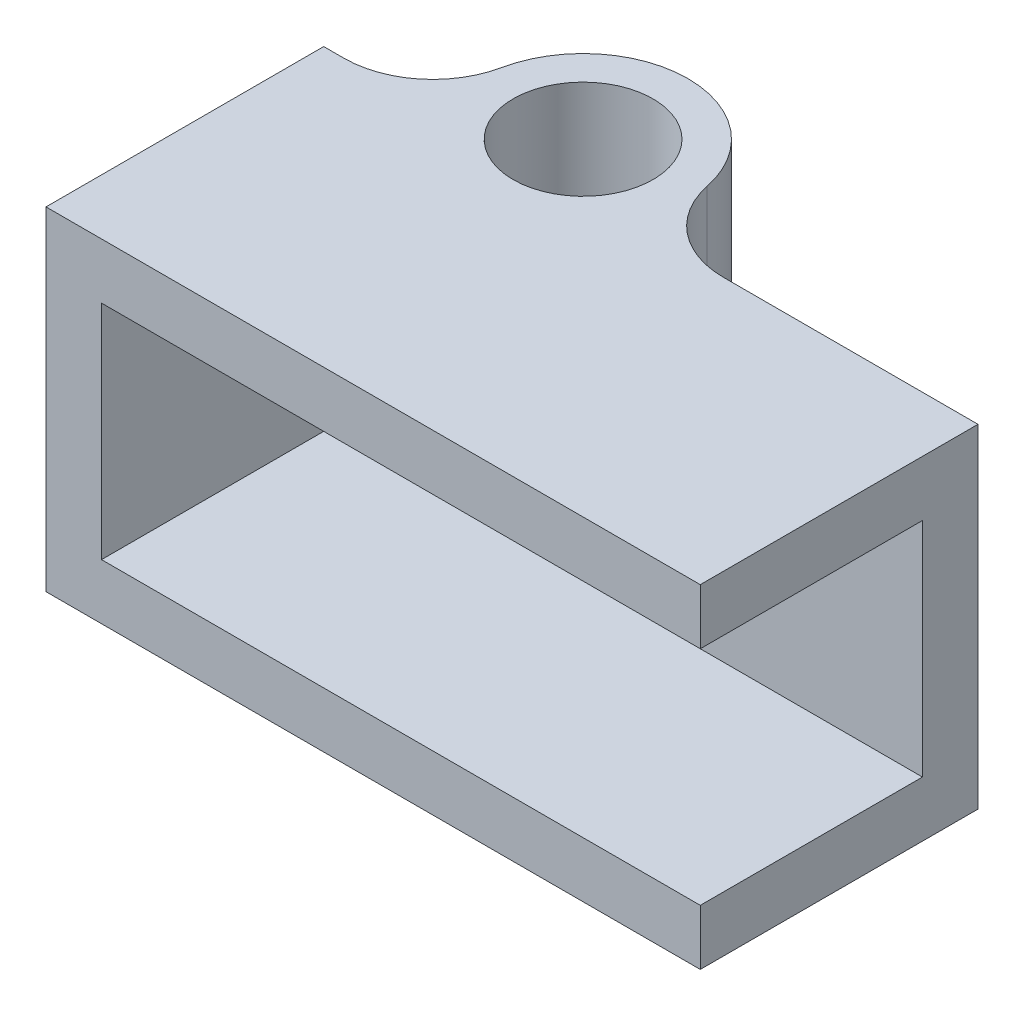
ISO-10303-21;
HEADER;
FILE_DESCRIPTION(('STEP AP214'),'2;1');
FILE_NAME('part.step','',(''),(''),'','','');
FILE_SCHEMA(('AUTOMOTIVE_DESIGN { 1 0 10303 214 1 1 1 1 }'));
ENDSEC;
DATA;
#1=APPLICATION_CONTEXT('core data for automotive mechanical design processes');
#2=APPLICATION_PROTOCOL_DEFINITION('international standard','automotive_design',2000,#1);
#3=PRODUCT_CONTEXT('',#1,'mechanical');
#4=PRODUCT('Part','Part','',(#3));
#5=PRODUCT_RELATED_PRODUCT_CATEGORY('part','',(#4));
#6=PRODUCT_DEFINITION_FORMATION('','',#4);
#7=PRODUCT_DEFINITION_CONTEXT('part definition',#1,'design');
#8=PRODUCT_DEFINITION('design','',#6,#7);
#9=PRODUCT_DEFINITION_SHAPE('','',#8);
#10=(LENGTH_UNIT() NAMED_UNIT(*) SI_UNIT(.MILLI.,.METRE.));
#11=(NAMED_UNIT(*) PLANE_ANGLE_UNIT() SI_UNIT($,.RADIAN.));
#12=(NAMED_UNIT(*) SI_UNIT($,.STERADIAN.) SOLID_ANGLE_UNIT());
#13=UNCERTAINTY_MEASURE_WITH_UNIT(LENGTH_MEASURE(1.E-05),#10,'distance_accuracy_value','');
#14=(GEOMETRIC_REPRESENTATION_CONTEXT(3) GLOBAL_UNCERTAINTY_ASSIGNED_CONTEXT((#13)) GLOBAL_UNIT_ASSIGNED_CONTEXT((#10,
#11,#12)) REPRESENTATION_CONTEXT('',''));
#15=CARTESIAN_POINT('',(0.,0.,0.));
#16=DIRECTION('',(0.,0.,1.));
#17=DIRECTION('',(1.,0.,0.));
#18=AXIS2_PLACEMENT_3D('',#15,#16,#17);
#19=CARTESIAN_POINT('',(0.,9.525,3.));
#20=DIRECTION('',(0.,0.,-1.));
#21=DIRECTION('',(-1.,0.,0.));
#22=AXIS2_PLACEMENT_3D('',#19,#20,#21);
#23=PLANE('',#22);
#24=DIRECTION('',(1.,0.,0.));
#25=VECTOR('',#24,1.);
#26=CARTESIAN_POINT('',(12.7,7.9375,3.));
#27=LINE('',#26,#25);
#28=CARTESIAN_POINT('',(-4.4125,7.9375,3.));
#29=VERTEX_POINT('',#28);
#30=CARTESIAN_POINT('',(12.7,7.9375,3.));
#31=VERTEX_POINT('',#30);
#32=EDGE_CURVE('E58',#29,#31,#27,.T.);
#33=ORIENTED_EDGE('',*,*,#32,.F.);
#34=DIRECTION('',(0.,1.,0.));
#35=VECTOR('',#34,1.);
#36=CARTESIAN_POINT('',(-4.4125,1.5875,3.));
#37=LINE('',#36,#35);
#38=CARTESIAN_POINT('',(-4.4125,1.5875,3.));
#39=VERTEX_POINT('',#38);
#40=EDGE_CURVE('E256',#39,#29,#37,.T.);
#41=ORIENTED_EDGE('',*,*,#40,.F.);
#42=DIRECTION('',(-1.,0.,0.));
#43=VECTOR('',#42,1.);
#44=CARTESIAN_POINT('',(12.7,1.5875,3.));
#45=LINE('',#44,#43);
#46=CARTESIAN_POINT('',(12.7,1.5875,3.));
#47=VERTEX_POINT('',#46);
#48=EDGE_CURVE('E63',#47,#39,#45,.T.);
#49=ORIENTED_EDGE('',*,*,#48,.F.);
#50=DIRECTION('',(0.,-1.,0.));
#51=VECTOR('',#50,1.);
#52=CARTESIAN_POINT('',(12.7,9.525,3.));
#53=LINE('',#52,#51);
#54=EDGE_CURVE('E152',#31,#47,#53,.T.);
#55=ORIENTED_EDGE('',*,*,#54,.F.);
#56=EDGE_LOOP('',(#33,#41,#49,#55));
#57=FACE_BOUND('',#56,.T.);
#58=ADVANCED_FACE('F43',(#57),#23,.F.);
#59=CARTESIAN_POINT('',(12.7,9.525,0.));
#60=DIRECTION('',(-1.,0.,0.));
#61=DIRECTION('',(0.,0.,1.));
#62=AXIS2_PLACEMENT_3D('',#59,#60,#61);
#63=PLANE('',#62);
#64=DIRECTION('',(0.,0.,-1.));
#65=VECTOR('',#64,1.);
#66=CARTESIAN_POINT('',(12.7,0.,0.));
#67=LINE('',#66,#65);
#68=CARTESIAN_POINT('',(12.7,0.,9.35));
#69=VERTEX_POINT('',#68);
#70=CARTESIAN_POINT('',(12.7,0.,1.4125));
#71=VERTEX_POINT('',#70);
#72=EDGE_CURVE('E156',#69,#71,#67,.T.);
#73=ORIENTED_EDGE('',*,*,#72,.T.);
#74=DIRECTION('',(0.,-1.,0.));
#75=VECTOR('',#74,1.);
#76=CARTESIAN_POINT('',(12.7,9.525,1.4125));
#77=LINE('',#76,#75);
#78=CARTESIAN_POINT('',(12.7,9.525,1.4125));
#79=VERTEX_POINT('',#78);
#80=EDGE_CURVE('E194',#79,#71,#77,.T.);
#81=ORIENTED_EDGE('',*,*,#80,.F.);
#82=DIRECTION('',(0.,0.,-1.));
#83=VECTOR('',#82,1.);
#84=CARTESIAN_POINT('',(12.7,9.525,0.));
#85=LINE('',#84,#83);
#86=CARTESIAN_POINT('',(12.7,9.525,9.35));
#87=VERTEX_POINT('',#86);
#88=EDGE_CURVE('E165',#87,#79,#85,.T.);
#89=ORIENTED_EDGE('',*,*,#88,.F.);
#90=DIRECTION('',(0.,1.,0.));
#91=VECTOR('',#90,1.);
#92=CARTESIAN_POINT('',(12.7,9.525,9.35));
#93=LINE('',#92,#91);
#94=CARTESIAN_POINT('',(12.7,7.9375,9.35));
#95=VERTEX_POINT('',#94);
#96=EDGE_CURVE('E246',#95,#87,#93,.T.);
#97=ORIENTED_EDGE('',*,*,#96,.F.);
#98=DIRECTION('',(0.,0.,-1.));
#99=VECTOR('',#98,1.);
#100=CARTESIAN_POINT('',(12.7,7.9375,9.35));
#101=LINE('',#100,#99);
#102=EDGE_CURVE('E254',#95,#31,#101,.T.);
#103=ORIENTED_EDGE('',*,*,#102,.T.);
#104=ORIENTED_EDGE('',*,*,#54,.T.);
#105=DIRECTION('',(0.,0.,-1.));
#106=VECTOR('',#105,1.);
#107=CARTESIAN_POINT('',(12.7,1.5875,9.35));
#108=LINE('',#107,#106);
#109=CARTESIAN_POINT('',(12.7,1.5875,9.35));
#110=VERTEX_POINT('',#109);
#111=EDGE_CURVE('E134',#110,#47,#108,.T.);
#112=ORIENTED_EDGE('',*,*,#111,.F.);
#113=DIRECTION('',(0.,1.,0.));
#114=VECTOR('',#113,1.);
#115=CARTESIAN_POINT('',(12.7,0.,9.35));
#116=LINE('',#115,#114);
#117=EDGE_CURVE('E140',#69,#110,#116,.T.);
#118=ORIENTED_EDGE('',*,*,#117,.F.);
#119=EDGE_LOOP('',(#73,#81,#89,#97,#103,#104,#112,#118));
#120=FACE_BOUND('',#119,.T.);
#121=ADVANCED_FACE('F150',(#120),#63,.F.);
#122=CARTESIAN_POINT('',(0.,9.525,1.4125));
#123=DIRECTION('',(0.,0.,1.));
#124=DIRECTION('',(1.,0.,0.));
#125=AXIS2_PLACEMENT_3D('',#122,#123,#124);
#126=PLANE('',#125);
#127=DIRECTION('',(-1.,0.,0.));
#128=VECTOR('',#127,1.);
#129=CARTESIAN_POINT('',(0.,0.,1.4125));
#130=LINE('',#129,#128);
#131=CARTESIAN_POINT('',(5.42405233658378,0.,1.4125));
#132=VERTEX_POINT('',#131);
#133=EDGE_CURVE('E182',#71,#132,#130,.T.);
#134=ORIENTED_EDGE('',*,*,#133,.T.);
#135=DIRECTION('',(0.,1.,0.));
#136=VECTOR('',#135,1.);
#137=CARTESIAN_POINT('',(5.42405233658378,9.525,1.4125));
#138=LINE('',#137,#136);
#139=CARTESIAN_POINT('',(5.42405233658378,9.525,1.4125));
#140=VERTEX_POINT('',#139);
#141=EDGE_CURVE('E206',#132,#140,#138,.T.);
#142=ORIENTED_EDGE('',*,*,#141,.T.);
#143=DIRECTION('',(-1.,0.,0.));
#144=VECTOR('',#143,1.);
#145=CARTESIAN_POINT('',(0.,9.525,1.4125));
#146=LINE('',#145,#144);
#147=EDGE_CURVE('E168',#79,#140,#146,.T.);
#148=ORIENTED_EDGE('',*,*,#147,.F.);
#149=ORIENTED_EDGE('',*,*,#80,.T.);
#150=EDGE_LOOP('',(#134,#142,#148,#149));
#151=FACE_BOUND('',#150,.T.);
#152=ADVANCED_FACE('F219',(#151),#126,.F.);
#153=CARTESIAN_POINT('',(0.,9.525,0.));
#154=DIRECTION('',(0.,-1.,0.));
#155=DIRECTION('',(0.,0.,-1.));
#156=AXIS2_PLACEMENT_3D('',#153,#154,#155);
#157=CYLINDRICAL_SURFACE('',#156,3.);
#158=CARTESIAN_POINT('',(0.,0.,0.));
#159=DIRECTION('',(0.,1.,0.));
#160=DIRECTION('',(0.,0.,1.));
#161=AXIS2_PLACEMENT_3D('',#158,#159,#160);
#162=CIRCLE('',#161,3.);
#163=CARTESIAN_POINT('',(2.93721245663382,0.,-0.610559566787004));
#164=VERTEX_POINT('',#163);
#165=CARTESIAN_POINT('',(-2.93721245663382,0.,-0.610559566787004));
#166=VERTEX_POINT('',#165);
#167=EDGE_CURVE('E185',#164,#166,#162,.T.);
#168=ORIENTED_EDGE('',*,*,#167,.T.);
#169=DIRECTION('',(0.,-1.,0.));
#170=VECTOR('',#169,1.);
#171=CARTESIAN_POINT('',(-2.93721245663382,9.525,-0.610559566787004));
#172=LINE('',#171,#170);
#173=CARTESIAN_POINT('',(-2.93721245663382,9.525,-0.610559566787004));
#174=VERTEX_POINT('',#173);
#175=EDGE_CURVE('E204',#166,#174,#172,.F.);
#176=ORIENTED_EDGE('',*,*,#175,.T.);
#177=CARTESIAN_POINT('',(0.,9.525,0.));
#178=DIRECTION('',(0.,1.,0.));
#179=DIRECTION('',(0.,0.,1.));
#180=AXIS2_PLACEMENT_3D('',#177,#178,#179);
#181=CIRCLE('',#180,3.);
#182=CARTESIAN_POINT('',(2.93721245663382,9.525,-0.610559566787004));
#183=VERTEX_POINT('',#182);
#184=EDGE_CURVE('E171',#183,#174,#181,.T.);
#185=ORIENTED_EDGE('',*,*,#184,.F.);
#186=DIRECTION('',(0.,-1.,0.));
#187=VECTOR('',#186,1.);
#188=CARTESIAN_POINT('',(2.93721245663382,9.525,-0.610559566787004));
#189=LINE('',#188,#187);
#190=EDGE_CURVE('E201',#183,#164,#189,.T.);
#191=ORIENTED_EDGE('',*,*,#190,.T.);
#192=EDGE_LOOP('',(#168,#176,#185,#191));
#193=FACE_BOUND('',#192,.T.);
#194=ADVANCED_FACE('F228',(#193),#157,.T.);
#195=CARTESIAN_POINT('',(0.,9.525,1.4125));
#196=DIRECTION('',(0.,0.,-1.));
#197=DIRECTION('',(-1.,0.,0.));
#198=AXIS2_PLACEMENT_3D('',#195,#196,#197);
#199=PLANE('',#198);
#200=DIRECTION('',(1.,0.,0.));
#201=VECTOR('',#200,1.);
#202=CARTESIAN_POINT('',(0.,9.525,1.4125));
#203=LINE('',#202,#201);
#204=CARTESIAN_POINT('',(-6.,9.525,1.4125));
#205=VERTEX_POINT('',#204);
#206=CARTESIAN_POINT('',(-5.42405233658378,9.525,1.4125));
#207=VERTEX_POINT('',#206);
#208=EDGE_CURVE('E174',#205,#207,#203,.T.);
#209=ORIENTED_EDGE('',*,*,#208,.T.);
#210=DIRECTION('',(0.,-1.,0.));
#211=VECTOR('',#210,1.);
#212=CARTESIAN_POINT('',(-5.42405233658378,9.525,1.4125));
#213=LINE('',#212,#211);
#214=CARTESIAN_POINT('',(-5.42405233658378,0.,1.4125));
#215=VERTEX_POINT('',#214);
#216=EDGE_CURVE('E198',#207,#215,#213,.T.);
#217=ORIENTED_EDGE('',*,*,#216,.T.);
#218=DIRECTION('',(1.,0.,0.));
#219=VECTOR('',#218,1.);
#220=CARTESIAN_POINT('',(0.,0.,1.4125));
#221=LINE('',#220,#219);
#222=CARTESIAN_POINT('',(-6.,0.,1.4125));
#223=VERTEX_POINT('',#222);
#224=EDGE_CURVE('E188',#223,#215,#221,.T.);
#225=ORIENTED_EDGE('',*,*,#224,.F.);
#226=DIRECTION('',(0.,-1.,0.));
#227=VECTOR('',#226,1.);
#228=CARTESIAN_POINT('',(-6.,9.525,1.4125));
#229=LINE('',#228,#227);
#230=EDGE_CURVE('E179',#205,#223,#229,.T.);
#231=ORIENTED_EDGE('',*,*,#230,.F.);
#232=EDGE_LOOP('',(#209,#217,#225,#231));
#233=FACE_BOUND('',#232,.T.);
#234=ADVANCED_FACE('F235',(#233),#199,.T.);
#235=CARTESIAN_POINT('',(0.,9.525,0.));
#236=DIRECTION('',(0.,-1.,0.));
#237=DIRECTION('',(0.,0.,-1.));
#238=AXIS2_PLACEMENT_3D('',#235,#236,#237);
#239=CYLINDRICAL_SURFACE('',#238,2.);
#240=CARTESIAN_POINT('',(0.,9.525,0.));
#241=DIRECTION('',(0.,1.,0.));
#242=DIRECTION('',(0.,0.,1.));
#243=AXIS2_PLACEMENT_3D('',#240,#241,#242);
#244=CIRCLE('',#243,2.);
#245=CARTESIAN_POINT('',(0.,9.525,2.));
#246=VERTEX_POINT('',#245);
#247=EDGE_CURVE('E162',#246,#246,#244,.T.);
#248=ORIENTED_EDGE('',*,*,#247,.T.);
#249=EDGE_LOOP('',(#248));
#250=FACE_BOUND('',#249,.T.);
#251=CARTESIAN_POINT('',(0.,0.,0.));
#252=DIRECTION('',(0.,1.,0.));
#253=DIRECTION('',(0.,0.,1.));
#254=AXIS2_PLACEMENT_3D('',#251,#252,#253);
#255=CIRCLE('',#254,2.);
#256=CARTESIAN_POINT('',(0.,0.,2.));
#257=VERTEX_POINT('',#256);
#258=EDGE_CURVE('E153',#257,#257,#255,.T.);
#259=ORIENTED_EDGE('',*,*,#258,.F.);
#260=EDGE_LOOP('',(#259));
#261=FACE_BOUND('',#260,.T.);
#262=ADVANCED_FACE('F275',(#250,#261),#239,.F.);
#263=CARTESIAN_POINT('',(-6.,9.525,0.));
#264=DIRECTION('',(-1.,0.,0.));
#265=DIRECTION('',(0.,0.,1.));
#266=AXIS2_PLACEMENT_3D('',#263,#264,#265);
#267=PLANE('',#266);
#268=DIRECTION('',(0.,0.,-1.));
#269=VECTOR('',#268,1.);
#270=CARTESIAN_POINT('',(-6.,0.,0.));
#271=LINE('',#270,#269);
#272=CARTESIAN_POINT('',(-6.,0.,9.35));
#273=VERTEX_POINT('',#272);
#274=EDGE_CURVE('E166',#273,#223,#271,.T.);
#275=ORIENTED_EDGE('',*,*,#274,.F.);
#276=DIRECTION('',(0.,-1.,0.));
#277=VECTOR('',#276,1.);
#278=CARTESIAN_POINT('',(-6.,0.,9.35));
#279=LINE('',#278,#277);
#280=CARTESIAN_POINT('',(-6.,9.525,9.35));
#281=VERTEX_POINT('',#280);
#282=EDGE_CURVE('E240',#281,#273,#279,.T.);
#283=ORIENTED_EDGE('',*,*,#282,.F.);
#284=DIRECTION('',(0.,0.,-1.));
#285=VECTOR('',#284,1.);
#286=CARTESIAN_POINT('',(-6.,9.525,0.));
#287=LINE('',#286,#285);
#288=EDGE_CURVE('E177',#281,#205,#287,.T.);
#289=ORIENTED_EDGE('',*,*,#288,.T.);
#290=ORIENTED_EDGE('',*,*,#230,.T.);
#291=EDGE_LOOP('',(#275,#283,#289,#290));
#292=FACE_BOUND('',#291,.T.);
#293=ADVANCED_FACE('F238',(#292),#267,.T.);
#294=CARTESIAN_POINT('',(0.,9.525,0.));
#295=DIRECTION('',(0.,1.,0.));
#296=DIRECTION('',(0.,0.,1.));
#297=AXIS2_PLACEMENT_3D('',#294,#295,#296);
#298=PLANE('',#297);
#299=ORIENTED_EDGE('',*,*,#247,.F.);
#300=EDGE_LOOP('',(#299));
#301=FACE_BOUND('',#300,.T.);
#302=ORIENTED_EDGE('',*,*,#288,.F.);
#303=DIRECTION('',(-1.,0.,0.));
#304=VECTOR('',#303,1.);
#305=CARTESIAN_POINT('',(-6.,9.525,9.35));
#306=LINE('',#305,#304);
#307=EDGE_CURVE('E243',#87,#281,#306,.T.);
#308=ORIENTED_EDGE('',*,*,#307,.F.);
#309=ORIENTED_EDGE('',*,*,#88,.T.);
#310=ORIENTED_EDGE('',*,*,#147,.T.);
#311=CARTESIAN_POINT('',(5.42405233658378,9.525,-1.1275));
#312=DIRECTION('',(0.,1.,0.));
#313=DIRECTION('',(0.,0.,1.));
#314=AXIS2_PLACEMENT_3D('',#311,#312,#313);
#315=CIRCLE('',#314,2.54);
#316=EDGE_CURVE('E11',#140,#183,#315,.F.);
#317=ORIENTED_EDGE('',*,*,#316,.T.);
#318=ORIENTED_EDGE('',*,*,#184,.T.);
#319=CARTESIAN_POINT('',(-5.42405233658378,9.525,-1.1275));
#320=DIRECTION('',(0.,1.,0.));
#321=DIRECTION('',(0.,0.,1.));
#322=AXIS2_PLACEMENT_3D('',#319,#320,#321);
#323=CIRCLE('',#322,2.54);
#324=EDGE_CURVE('E210',#174,#207,#323,.F.);
#325=ORIENTED_EDGE('',*,*,#324,.T.);
#326=ORIENTED_EDGE('',*,*,#208,.F.);
#327=EDGE_LOOP('',(#302,#308,#309,#310,#317,#318,#325,#326));
#328=FACE_BOUND('',#327,.T.);
#329=ADVANCED_FACE('F225',(#301,#328),#298,.T.);
#330=CARTESIAN_POINT('',(0.,0.,0.));
#331=DIRECTION('',(0.,1.,0.));
#332=DIRECTION('',(0.,0.,1.));
#333=AXIS2_PLACEMENT_3D('',#330,#331,#332);
#334=PLANE('',#333);
#335=ORIENTED_EDGE('',*,*,#258,.T.);
#336=EDGE_LOOP('',(#335));
#337=FACE_BOUND('',#336,.T.);
#338=ORIENTED_EDGE('',*,*,#72,.F.);
#339=DIRECTION('',(1.,0.,0.));
#340=VECTOR('',#339,1.);
#341=CARTESIAN_POINT('',(12.7,0.,9.35));
#342=LINE('',#341,#340);
#343=EDGE_CURVE('E147',#273,#69,#342,.T.);
#344=ORIENTED_EDGE('',*,*,#343,.F.);
#345=ORIENTED_EDGE('',*,*,#274,.T.);
#346=ORIENTED_EDGE('',*,*,#224,.T.);
#347=CARTESIAN_POINT('',(-5.42405233658378,0.,-1.1275));
#348=DIRECTION('',(0.,1.,0.));
#349=DIRECTION('',(0.,0.,1.));
#350=AXIS2_PLACEMENT_3D('',#347,#348,#349);
#351=CIRCLE('',#350,2.54);
#352=EDGE_CURVE('E208',#215,#166,#351,.T.);
#353=ORIENTED_EDGE('',*,*,#352,.T.);
#354=ORIENTED_EDGE('',*,*,#167,.F.);
#355=CARTESIAN_POINT('',(5.42405233658378,0.,-1.1275));
#356=DIRECTION('',(0.,1.,0.));
#357=DIRECTION('',(0.,0.,1.));
#358=AXIS2_PLACEMENT_3D('',#355,#356,#357);
#359=CIRCLE('',#358,2.54);
#360=EDGE_CURVE('E51',#164,#132,#359,.T.);
#361=ORIENTED_EDGE('',*,*,#360,.T.);
#362=ORIENTED_EDGE('',*,*,#133,.F.);
#363=EDGE_LOOP('',(#338,#344,#345,#346,#353,#354,#361,#362));
#364=FACE_BOUND('',#363,.T.);
#365=ADVANCED_FACE('F214',(#337,#364),#334,.F.);
#366=CARTESIAN_POINT('',(-5.42405233658378,9.525,-1.1275));
#367=DIRECTION('',(0.,-1.,0.));
#368=DIRECTION('',(0.,0.,-1.));
#369=AXIS2_PLACEMENT_3D('',#366,#367,#368);
#370=CYLINDRICAL_SURFACE('',#369,2.54);
#371=ORIENTED_EDGE('',*,*,#324,.F.);
#372=ORIENTED_EDGE('',*,*,#175,.F.);
#373=ORIENTED_EDGE('',*,*,#352,.F.);
#374=ORIENTED_EDGE('',*,*,#216,.F.);
#375=EDGE_LOOP('',(#371,#372,#373,#374));
#376=FACE_BOUND('',#375,.T.);
#377=ADVANCED_FACE('F231',(#376),#370,.F.);
#378=CARTESIAN_POINT('',(5.42405233658378,9.525,-1.1275));
#379=DIRECTION('',(0.,-1.,0.));
#380=DIRECTION('',(0.,0.,-1.));
#381=AXIS2_PLACEMENT_3D('',#378,#379,#380);
#382=CYLINDRICAL_SURFACE('',#381,2.54);
#383=ORIENTED_EDGE('',*,*,#316,.F.);
#384=ORIENTED_EDGE('',*,*,#141,.F.);
#385=ORIENTED_EDGE('',*,*,#360,.F.);
#386=ORIENTED_EDGE('',*,*,#190,.F.);
#387=EDGE_LOOP('',(#383,#384,#385,#386));
#388=FACE_BOUND('',#387,.T.);
#389=ADVANCED_FACE('F45',(#388),#382,.F.);
#390=CARTESIAN_POINT('',(12.7,1.5875,9.35));
#391=DIRECTION('',(0.,-1.,0.));
#392=DIRECTION('',(1.,0.,0.));
#393=AXIS2_PLACEMENT_3D('',#390,#391,#392);
#394=PLANE('',#393);
#395=ORIENTED_EDGE('',*,*,#48,.T.);
#396=DIRECTION('',(0.,0.,-1.));
#397=VECTOR('',#396,1.);
#398=CARTESIAN_POINT('',(-4.4125,1.5875,9.35));
#399=LINE('',#398,#397);
#400=CARTESIAN_POINT('',(-4.4125,1.5875,9.35));
#401=VERTEX_POINT('',#400);
#402=EDGE_CURVE('E136',#401,#39,#399,.T.);
#403=ORIENTED_EDGE('',*,*,#402,.F.);
#404=DIRECTION('',(-1.,0.,0.));
#405=VECTOR('',#404,1.);
#406=CARTESIAN_POINT('',(12.7,1.5875,9.35));
#407=LINE('',#406,#405);
#408=EDGE_CURVE('E130',#110,#401,#407,.T.);
#409=ORIENTED_EDGE('',*,*,#408,.F.);
#410=ORIENTED_EDGE('',*,*,#111,.T.);
#411=EDGE_LOOP('',(#395,#403,#409,#410));
#412=FACE_BOUND('',#411,.T.);
#413=ADVANCED_FACE('F132',(#412),#394,.F.);
#414=CARTESIAN_POINT('',(-4.4125,1.5875,9.35));
#415=DIRECTION('',(-1.,0.,0.));
#416=DIRECTION('',(0.,0.,1.));
#417=AXIS2_PLACEMENT_3D('',#414,#415,#416);
#418=PLANE('',#417);
#419=ORIENTED_EDGE('',*,*,#40,.T.);
#420=DIRECTION('',(0.,0.,-1.));
#421=VECTOR('',#420,1.);
#422=CARTESIAN_POINT('',(-4.4125,7.9375,9.35));
#423=LINE('',#422,#421);
#424=CARTESIAN_POINT('',(-4.4125,7.9375,9.35));
#425=VERTEX_POINT('',#424);
#426=EDGE_CURVE('E158',#425,#29,#423,.T.);
#427=ORIENTED_EDGE('',*,*,#426,.F.);
#428=DIRECTION('',(0.,1.,0.));
#429=VECTOR('',#428,1.);
#430=CARTESIAN_POINT('',(-4.4125,1.5875,9.35));
#431=LINE('',#430,#429);
#432=EDGE_CURVE('E139',#401,#425,#431,.T.);
#433=ORIENTED_EDGE('',*,*,#432,.F.);
#434=ORIENTED_EDGE('',*,*,#402,.T.);
#435=EDGE_LOOP('',(#419,#427,#433,#434));
#436=FACE_BOUND('',#435,.T.);
#437=ADVANCED_FACE('F266',(#436),#418,.F.);
#438=CARTESIAN_POINT('',(12.7,7.9375,9.35));
#439=DIRECTION('',(0.,1.,0.));
#440=DIRECTION('',(-1.,0.,0.));
#441=AXIS2_PLACEMENT_3D('',#438,#439,#440);
#442=PLANE('',#441);
#443=ORIENTED_EDGE('',*,*,#32,.T.);
#444=ORIENTED_EDGE('',*,*,#102,.F.);
#445=DIRECTION('',(1.,0.,0.));
#446=VECTOR('',#445,1.);
#447=CARTESIAN_POINT('',(12.7,7.9375,9.35));
#448=LINE('',#447,#446);
#449=EDGE_CURVE('E249',#425,#95,#448,.T.);
#450=ORIENTED_EDGE('',*,*,#449,.F.);
#451=ORIENTED_EDGE('',*,*,#426,.T.);
#452=EDGE_LOOP('',(#443,#444,#450,#451));
#453=FACE_BOUND('',#452,.T.);
#454=ADVANCED_FACE('F263',(#453),#442,.F.);
#455=CARTESIAN_POINT('',(0.,0.,9.35));
#456=DIRECTION('',(0.,0.,1.));
#457=DIRECTION('',(1.,0.,0.));
#458=AXIS2_PLACEMENT_3D('',#455,#456,#457);
#459=PLANE('',#458);
#460=ORIENTED_EDGE('',*,*,#117,.T.);
#461=ORIENTED_EDGE('',*,*,#408,.T.);
#462=ORIENTED_EDGE('',*,*,#432,.T.);
#463=ORIENTED_EDGE('',*,*,#449,.T.);
#464=ORIENTED_EDGE('',*,*,#96,.T.);
#465=ORIENTED_EDGE('',*,*,#307,.T.);
#466=ORIENTED_EDGE('',*,*,#282,.T.);
#467=ORIENTED_EDGE('',*,*,#343,.T.);
#468=EDGE_LOOP('',(#460,#461,#462,#463,#464,#465,#466,#467));
#469=FACE_BOUND('',#468,.T.);
#470=ADVANCED_FACE('F144',(#469),#459,.T.);
#471=CLOSED_SHELL('',(#58,#121,#152,#194,#234,#262,#293,#329,#365,#377,#389,#413,#437,#454,#470));
#472=MANIFOLD_SOLID_BREP('B2',#471);
#473=ADVANCED_BREP_SHAPE_REPRESENTATION('',(#18,#472),#14);
#474=SHAPE_DEFINITION_REPRESENTATION(#9,#473);
ENDSEC;
END-ISO-10303-21;
